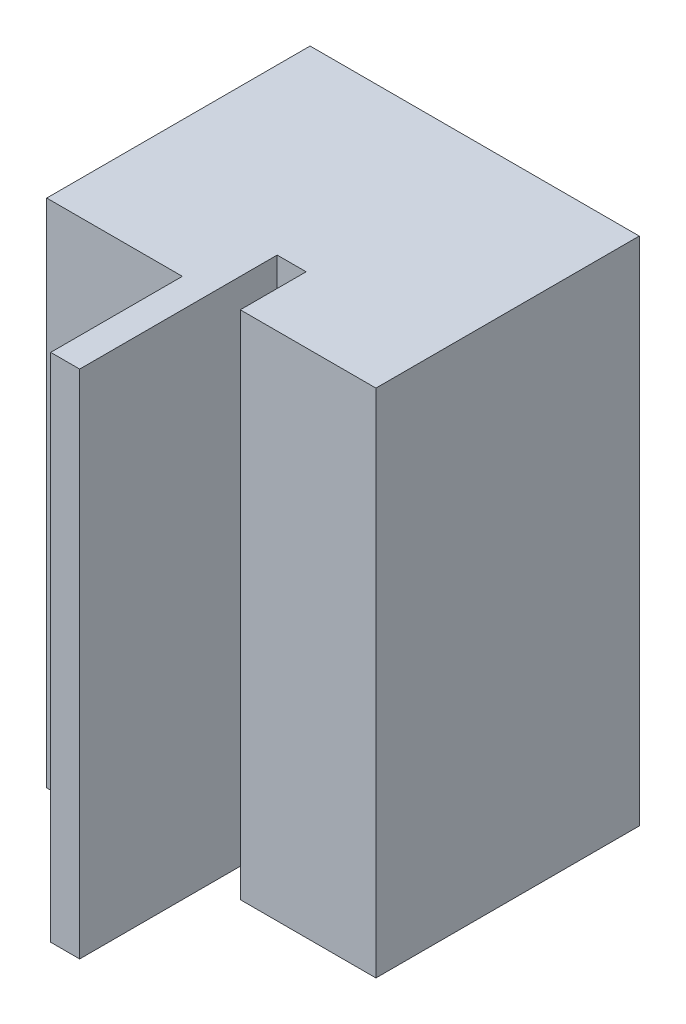
ISO-10303-21;
HEADER;
FILE_DESCRIPTION(('STEP AP214'),'2;1');
FILE_NAME('part.step','',(''),(''),'','','');
FILE_SCHEMA(('AUTOMOTIVE_DESIGN { 1 0 10303 214 1 1 1 1 }'));
ENDSEC;
DATA;
#1=APPLICATION_CONTEXT('core data for automotive mechanical design processes');
#2=APPLICATION_PROTOCOL_DEFINITION('international standard','automotive_design',2000,#1);
#3=PRODUCT_CONTEXT('',#1,'mechanical');
#4=PRODUCT('Part','Part','',(#3));
#5=PRODUCT_RELATED_PRODUCT_CATEGORY('part','',(#4));
#6=PRODUCT_DEFINITION_FORMATION('','',#4);
#7=PRODUCT_DEFINITION_CONTEXT('part definition',#1,'design');
#8=PRODUCT_DEFINITION('design','',#6,#7);
#9=PRODUCT_DEFINITION_SHAPE('','',#8);
#10=(LENGTH_UNIT() NAMED_UNIT(*) SI_UNIT(.MILLI.,.METRE.));
#11=(NAMED_UNIT(*) PLANE_ANGLE_UNIT() SI_UNIT($,.RADIAN.));
#12=(NAMED_UNIT(*) SI_UNIT($,.STERADIAN.) SOLID_ANGLE_UNIT());
#13=UNCERTAINTY_MEASURE_WITH_UNIT(LENGTH_MEASURE(1.E-05),#10,'distance_accuracy_value','');
#14=(GEOMETRIC_REPRESENTATION_CONTEXT(3) GLOBAL_UNCERTAINTY_ASSIGNED_CONTEXT((#13)) GLOBAL_UNIT_ASSIGNED_CONTEXT((#10,
#11,#12)) REPRESENTATION_CONTEXT('',''));
#15=CARTESIAN_POINT('',(0.,0.,0.));
#16=DIRECTION('',(0.,0.,1.));
#17=DIRECTION('',(1.,0.,0.));
#18=AXIS2_PLACEMENT_3D('',#15,#16,#17);
#19=CARTESIAN_POINT('',(0.,38.8,0.));
#20=DIRECTION('',(0.,-1.,0.));
#21=DIRECTION('',(0.,0.,-1.));
#22=AXIS2_PLACEMENT_3D('',#19,#20,#21);
#23=PLANE('',#22);
#24=DIRECTION('',(0.,0.,1.));
#25=VECTOR('',#24,1.);
#26=CARTESIAN_POINT('',(0.,38.8,20.));
#27=LINE('',#26,#25);
#28=CARTESIAN_POINT('',(0.,38.8,5.));
#29=VERTEX_POINT('',#28);
#30=CARTESIAN_POINT('',(0.,38.8,20.));
#31=VERTEX_POINT('',#30);
#32=EDGE_CURVE('E48',#29,#31,#27,.T.);
#33=ORIENTED_EDGE('',*,*,#32,.F.);
#34=DIRECTION('',(1.,0.,0.));
#35=VECTOR('',#34,1.);
#36=CARTESIAN_POINT('',(0.,38.8,5.));
#37=LINE('',#36,#35);
#38=CARTESIAN_POINT('',(2.2,38.8,5.));
#39=VERTEX_POINT('',#38);
#40=EDGE_CURVE('E142',#29,#39,#37,.T.);
#41=ORIENTED_EDGE('',*,*,#40,.T.);
#42=DIRECTION('',(0.,0.,1.));
#43=VECTOR('',#42,1.);
#44=CARTESIAN_POINT('',(2.2,38.8,20.));
#45=LINE('',#44,#43);
#46=CARTESIAN_POINT('',(2.2,38.8,10.));
#47=VERTEX_POINT('',#46);
#48=EDGE_CURVE('E118',#39,#47,#45,.T.);
#49=ORIENTED_EDGE('',*,*,#48,.T.);
#50=DIRECTION('',(1.,0.,0.));
#51=VECTOR('',#50,1.);
#52=CARTESIAN_POINT('',(-12.5,38.8,10.));
#53=LINE('',#52,#51);
#54=CARTESIAN_POINT('',(12.5,38.8,10.));
#55=VERTEX_POINT('',#54);
#56=EDGE_CURVE('E155',#47,#55,#53,.T.);
#57=ORIENTED_EDGE('',*,*,#56,.T.);
#58=DIRECTION('',(0.,0.,-1.));
#59=VECTOR('',#58,1.);
#60=CARTESIAN_POINT('',(12.5,38.8,10.));
#61=LINE('',#60,#59);
#62=CARTESIAN_POINT('',(12.5,38.8,-10.));
#63=VERTEX_POINT('',#62);
#64=EDGE_CURVE('E147',#55,#63,#61,.T.);
#65=ORIENTED_EDGE('',*,*,#64,.T.);
#66=DIRECTION('',(-1.,0.,0.));
#67=VECTOR('',#66,1.);
#68=CARTESIAN_POINT('',(-12.5,38.8,-10.));
#69=LINE('',#68,#67);
#70=CARTESIAN_POINT('',(-12.5,38.8,-10.));
#71=VERTEX_POINT('',#70);
#72=EDGE_CURVE('E150',#63,#71,#69,.T.);
#73=ORIENTED_EDGE('',*,*,#72,.T.);
#74=DIRECTION('',(0.,0.,1.));
#75=VECTOR('',#74,1.);
#76=CARTESIAN_POINT('',(-12.5,38.8,10.));
#77=LINE('',#76,#75);
#78=CARTESIAN_POINT('',(-12.5,38.8,10.));
#79=VERTEX_POINT('',#78);
#80=EDGE_CURVE('E153',#71,#79,#77,.T.);
#81=ORIENTED_EDGE('',*,*,#80,.T.);
#82=CARTESIAN_POINT('',(-2.2,38.8,10.));
#83=VERTEX_POINT('',#82);
#84=EDGE_CURVE('E156',#79,#83,#53,.T.);
#85=ORIENTED_EDGE('',*,*,#84,.T.);
#86=DIRECTION('',(0.,0.,1.));
#87=VECTOR('',#86,1.);
#88=CARTESIAN_POINT('',(-2.2,38.8,20.));
#89=LINE('',#88,#87);
#90=CARTESIAN_POINT('',(-2.2,38.8,20.));
#91=VERTEX_POINT('',#90);
#92=EDGE_CURVE('E56',#83,#91,#89,.T.);
#93=ORIENTED_EDGE('',*,*,#92,.T.);
#94=DIRECTION('',(1.,0.,0.));
#95=VECTOR('',#94,1.);
#96=CARTESIAN_POINT('',(-2.2,38.8,20.));
#97=LINE('',#96,#95);
#98=EDGE_CURVE('E137',#91,#31,#97,.T.);
#99=ORIENTED_EDGE('',*,*,#98,.T.);
#100=EDGE_LOOP('',(#33,#41,#49,#57,#65,#73,#81,#85,#93,#99));
#101=FACE_BOUND('',#100,.T.);
#102=ADVANCED_FACE('F33',(#101),#23,.F.);
#103=CARTESIAN_POINT('',(0.,0.,0.));
#104=DIRECTION('',(0.,-1.,0.));
#105=DIRECTION('',(0.,0.,-1.));
#106=AXIS2_PLACEMENT_3D('',#103,#104,#105);
#107=PLANE('',#106);
#108=DIRECTION('',(1.,0.,0.));
#109=VECTOR('',#108,1.);
#110=CARTESIAN_POINT('',(0.,0.,5.));
#111=LINE('',#110,#109);
#112=CARTESIAN_POINT('',(0.,0.,5.));
#113=VERTEX_POINT('',#112);
#114=CARTESIAN_POINT('',(2.2,0.,5.));
#115=VERTEX_POINT('',#114);
#116=EDGE_CURVE('E126',#113,#115,#111,.T.);
#117=ORIENTED_EDGE('',*,*,#116,.F.);
#118=DIRECTION('',(0.,0.,-1.));
#119=VECTOR('',#118,1.);
#120=CARTESIAN_POINT('',(0.,0.,20.));
#121=LINE('',#120,#119);
#122=CARTESIAN_POINT('',(0.,0.,20.));
#123=VERTEX_POINT('',#122);
#124=EDGE_CURVE('E112',#123,#113,#121,.T.);
#125=ORIENTED_EDGE('',*,*,#124,.F.);
#126=DIRECTION('',(1.,0.,0.));
#127=VECTOR('',#126,1.);
#128=CARTESIAN_POINT('',(-2.2,0.,20.));
#129=LINE('',#128,#127);
#130=CARTESIAN_POINT('',(-2.2,0.,20.));
#131=VERTEX_POINT('',#130);
#132=EDGE_CURVE('E124',#131,#123,#129,.T.);
#133=ORIENTED_EDGE('',*,*,#132,.F.);
#134=DIRECTION('',(0.,0.,1.));
#135=VECTOR('',#134,1.);
#136=CARTESIAN_POINT('',(-2.2,0.,20.));
#137=LINE('',#136,#135);
#138=CARTESIAN_POINT('',(-2.2,0.,10.));
#139=VERTEX_POINT('',#138);
#140=EDGE_CURVE('E133',#139,#131,#137,.T.);
#141=ORIENTED_EDGE('',*,*,#140,.F.);
#142=DIRECTION('',(1.,0.,0.));
#143=VECTOR('',#142,1.);
#144=CARTESIAN_POINT('',(-12.5,0.,10.));
#145=LINE('',#144,#143);
#146=CARTESIAN_POINT('',(-12.5,0.,10.));
#147=VERTEX_POINT('',#146);
#148=EDGE_CURVE('E151',#147,#139,#145,.T.);
#149=ORIENTED_EDGE('',*,*,#148,.F.);
#150=DIRECTION('',(0.,0.,1.));
#151=VECTOR('',#150,1.);
#152=CARTESIAN_POINT('',(-12.5,0.,10.));
#153=LINE('',#152,#151);
#154=CARTESIAN_POINT('',(-12.5,0.,-10.));
#155=VERTEX_POINT('',#154);
#156=EDGE_CURVE('E164',#155,#147,#153,.T.);
#157=ORIENTED_EDGE('',*,*,#156,.F.);
#158=DIRECTION('',(-1.,0.,0.));
#159=VECTOR('',#158,1.);
#160=CARTESIAN_POINT('',(-12.5,0.,-10.));
#161=LINE('',#160,#159);
#162=CARTESIAN_POINT('',(12.5,0.,-10.));
#163=VERTEX_POINT('',#162);
#164=EDGE_CURVE('E162',#163,#155,#161,.T.);
#165=ORIENTED_EDGE('',*,*,#164,.F.);
#166=DIRECTION('',(0.,0.,-1.));
#167=VECTOR('',#166,1.);
#168=CARTESIAN_POINT('',(12.5,0.,10.));
#169=LINE('',#168,#167);
#170=CARTESIAN_POINT('',(12.5,0.,10.));
#171=VERTEX_POINT('',#170);
#172=EDGE_CURVE('E145',#171,#163,#169,.T.);
#173=ORIENTED_EDGE('',*,*,#172,.F.);
#174=CARTESIAN_POINT('',(2.2,0.,10.));
#175=VERTEX_POINT('',#174);
#176=EDGE_CURVE('E166',#175,#171,#145,.T.);
#177=ORIENTED_EDGE('',*,*,#176,.F.);
#178=DIRECTION('',(0.,0.,-1.));
#179=VECTOR('',#178,1.);
#180=CARTESIAN_POINT('',(2.2,0.,20.));
#181=LINE('',#180,#179);
#182=EDGE_CURVE('E193',#175,#115,#181,.T.);
#183=ORIENTED_EDGE('',*,*,#182,.T.);
#184=EDGE_LOOP('',(#117,#125,#133,#141,#149,#157,#165,#173,#177,#183));
#185=FACE_BOUND('',#184,.T.);
#186=ADVANCED_FACE('F122',(#185),#107,.T.);
#187=CARTESIAN_POINT('',(-2.2,0.,20.));
#188=DIRECTION('',(0.,0.,1.));
#189=DIRECTION('',(1.,0.,0.));
#190=AXIS2_PLACEMENT_3D('',#187,#188,#189);
#191=PLANE('',#190);
#192=ORIENTED_EDGE('',*,*,#132,.T.);
#193=DIRECTION('',(0.,-1.,0.));
#194=VECTOR('',#193,1.);
#195=CARTESIAN_POINT('',(0.,38.8,20.));
#196=LINE('',#195,#194);
#197=EDGE_CURVE('E109',#31,#123,#196,.T.);
#198=ORIENTED_EDGE('',*,*,#197,.F.);
#199=ORIENTED_EDGE('',*,*,#98,.F.);
#200=DIRECTION('',(0.,1.,0.));
#201=VECTOR('',#200,1.);
#202=CARTESIAN_POINT('',(-2.2,0.,20.));
#203=LINE('',#202,#201);
#204=EDGE_CURVE('E130',#131,#91,#203,.T.);
#205=ORIENTED_EDGE('',*,*,#204,.F.);
#206=EDGE_LOOP('',(#192,#198,#199,#205));
#207=FACE_BOUND('',#206,.T.);
#208=ADVANCED_FACE('F129',(#207),#191,.T.);
#209=CARTESIAN_POINT('',(-12.5,38.8,10.));
#210=DIRECTION('',(0.,0.,-1.));
#211=DIRECTION('',(-1.,0.,0.));
#212=AXIS2_PLACEMENT_3D('',#209,#210,#211);
#213=PLANE('',#212);
#214=DIRECTION('',(0.,1.,0.));
#215=VECTOR('',#214,1.);
#216=CARTESIAN_POINT('',(2.2,0.,10.));
#217=LINE('',#216,#215);
#218=EDGE_CURVE('E132',#175,#47,#217,.T.);
#219=ORIENTED_EDGE('',*,*,#218,.F.);
#220=ORIENTED_EDGE('',*,*,#176,.T.);
#221=DIRECTION('',(0.,-1.,0.));
#222=VECTOR('',#221,1.);
#223=CARTESIAN_POINT('',(12.5,38.8,10.));
#224=LINE('',#223,#222);
#225=EDGE_CURVE('E159',#55,#171,#224,.T.);
#226=ORIENTED_EDGE('',*,*,#225,.F.);
#227=ORIENTED_EDGE('',*,*,#56,.F.);
#228=EDGE_LOOP('',(#219,#220,#226,#227));
#229=FACE_BOUND('',#228,.T.);
#230=ADVANCED_FACE('F196',(#229),#213,.F.);
#231=CARTESIAN_POINT('',(12.5,38.8,10.));
#232=DIRECTION('',(-1.,0.,0.));
#233=DIRECTION('',(0.,0.,1.));
#234=AXIS2_PLACEMENT_3D('',#231,#232,#233);
#235=PLANE('',#234);
#236=ORIENTED_EDGE('',*,*,#172,.T.);
#237=DIRECTION('',(0.,-1.,0.));
#238=VECTOR('',#237,1.);
#239=CARTESIAN_POINT('',(12.5,38.8,-10.));
#240=LINE('',#239,#238);
#241=EDGE_CURVE('E11',#63,#163,#240,.T.);
#242=ORIENTED_EDGE('',*,*,#241,.F.);
#243=ORIENTED_EDGE('',*,*,#64,.F.);
#244=ORIENTED_EDGE('',*,*,#225,.T.);
#245=EDGE_LOOP('',(#236,#242,#243,#244));
#246=FACE_BOUND('',#245,.T.);
#247=ADVANCED_FACE('F35',(#246),#235,.F.);
#248=CARTESIAN_POINT('',(-12.5,38.8,-10.));
#249=DIRECTION('',(0.,0.,1.));
#250=DIRECTION('',(1.,0.,0.));
#251=AXIS2_PLACEMENT_3D('',#248,#249,#250);
#252=PLANE('',#251);
#253=ORIENTED_EDGE('',*,*,#164,.T.);
#254=DIRECTION('',(0.,-1.,0.));
#255=VECTOR('',#254,1.);
#256=CARTESIAN_POINT('',(-12.5,38.8,-10.));
#257=LINE('',#256,#255);
#258=EDGE_CURVE('E41',#71,#155,#257,.T.);
#259=ORIENTED_EDGE('',*,*,#258,.F.);
#260=ORIENTED_EDGE('',*,*,#72,.F.);
#261=ORIENTED_EDGE('',*,*,#241,.T.);
#262=EDGE_LOOP('',(#253,#259,#260,#261));
#263=FACE_BOUND('',#262,.T.);
#264=ADVANCED_FACE('F189',(#263),#252,.F.);
#265=CARTESIAN_POINT('',(-12.5,38.8,10.));
#266=DIRECTION('',(1.,0.,0.));
#267=DIRECTION('',(0.,0.,-1.));
#268=AXIS2_PLACEMENT_3D('',#265,#266,#267);
#269=PLANE('',#268);
#270=ORIENTED_EDGE('',*,*,#156,.T.);
#271=DIRECTION('',(0.,-1.,0.));
#272=VECTOR('',#271,1.);
#273=CARTESIAN_POINT('',(-12.5,38.8,10.));
#274=LINE('',#273,#272);
#275=EDGE_CURVE('E171',#79,#147,#274,.T.);
#276=ORIENTED_EDGE('',*,*,#275,.F.);
#277=ORIENTED_EDGE('',*,*,#80,.F.);
#278=ORIENTED_EDGE('',*,*,#258,.T.);
#279=EDGE_LOOP('',(#270,#276,#277,#278));
#280=FACE_BOUND('',#279,.T.);
#281=ADVANCED_FACE('F178',(#280),#269,.F.);
#282=ORIENTED_EDGE('',*,*,#148,.T.);
#283=DIRECTION('',(0.,1.,0.));
#284=VECTOR('',#283,1.);
#285=CARTESIAN_POINT('',(-2.2,0.,10.));
#286=LINE('',#285,#284);
#287=EDGE_CURVE('E135',#139,#83,#286,.T.);
#288=ORIENTED_EDGE('',*,*,#287,.T.);
#289=ORIENTED_EDGE('',*,*,#84,.F.);
#290=ORIENTED_EDGE('',*,*,#275,.T.);
#291=EDGE_LOOP('',(#282,#288,#289,#290));
#292=FACE_BOUND('',#291,.T.);
#293=ADVANCED_FACE('F184',(#292),#213,.F.);
#294=CARTESIAN_POINT('',(-2.2,0.,20.));
#295=DIRECTION('',(-1.,0.,0.));
#296=DIRECTION('',(0.,0.,1.));
#297=AXIS2_PLACEMENT_3D('',#294,#295,#296);
#298=PLANE('',#297);
#299=ORIENTED_EDGE('',*,*,#92,.F.);
#300=ORIENTED_EDGE('',*,*,#287,.F.);
#301=ORIENTED_EDGE('',*,*,#140,.T.);
#302=ORIENTED_EDGE('',*,*,#204,.T.);
#303=EDGE_LOOP('',(#299,#300,#301,#302));
#304=FACE_BOUND('',#303,.T.);
#305=ADVANCED_FACE('F220',(#304),#298,.T.);
#306=CARTESIAN_POINT('',(2.2,0.,0.));
#307=DIRECTION('',(1.,0.,0.));
#308=DIRECTION('',(0.,0.,-1.));
#309=AXIS2_PLACEMENT_3D('',#306,#307,#308);
#310=PLANE('',#309);
#311=ORIENTED_EDGE('',*,*,#48,.F.);
#312=DIRECTION('',(0.,1.,0.));
#313=VECTOR('',#312,1.);
#314=CARTESIAN_POINT('',(2.2,38.8,5.));
#315=LINE('',#314,#313);
#316=EDGE_CURVE('E204',#115,#39,#315,.T.);
#317=ORIENTED_EDGE('',*,*,#316,.F.);
#318=ORIENTED_EDGE('',*,*,#182,.F.);
#319=ORIENTED_EDGE('',*,*,#218,.T.);
#320=EDGE_LOOP('',(#311,#317,#318,#319));
#321=FACE_BOUND('',#320,.T.);
#322=ADVANCED_FACE('F201',(#321),#310,.F.);
#323=CARTESIAN_POINT('',(0.,38.8,5.));
#324=DIRECTION('',(0.,0.,-1.));
#325=DIRECTION('',(0.,1.,0.));
#326=AXIS2_PLACEMENT_3D('',#323,#324,#325);
#327=PLANE('',#326);
#328=ORIENTED_EDGE('',*,*,#316,.T.);
#329=ORIENTED_EDGE('',*,*,#40,.F.);
#330=DIRECTION('',(0.,1.,0.));
#331=VECTOR('',#330,1.);
#332=CARTESIAN_POINT('',(0.,38.8,5.));
#333=LINE('',#332,#331);
#334=EDGE_CURVE('E127',#113,#29,#333,.T.);
#335=ORIENTED_EDGE('',*,*,#334,.F.);
#336=ORIENTED_EDGE('',*,*,#116,.T.);
#337=EDGE_LOOP('',(#328,#329,#335,#336));
#338=FACE_BOUND('',#337,.T.);
#339=ADVANCED_FACE('F212',(#338),#327,.F.);
#340=CARTESIAN_POINT('',(0.,0.,0.));
#341=DIRECTION('',(1.,0.,0.));
#342=DIRECTION('',(0.,0.,-1.));
#343=AXIS2_PLACEMENT_3D('',#340,#341,#342);
#344=PLANE('',#343);
#345=ORIENTED_EDGE('',*,*,#197,.T.);
#346=ORIENTED_EDGE('',*,*,#124,.T.);
#347=ORIENTED_EDGE('',*,*,#334,.T.);
#348=ORIENTED_EDGE('',*,*,#32,.T.);
#349=EDGE_LOOP('',(#345,#346,#347,#348));
#350=FACE_BOUND('',#349,.T.);
#351=ADVANCED_FACE('F111',(#350),#344,.T.);
#352=CLOSED_SHELL('',(#102,#186,#208,#230,#247,#264,#281,#293,#305,#322,#339,#351));
#353=MANIFOLD_SOLID_BREP('B2',#352);
#354=ADVANCED_BREP_SHAPE_REPRESENTATION('',(#18,#353),#14);
#355=SHAPE_DEFINITION_REPRESENTATION(#9,#354);
ENDSEC;
END-ISO-10303-21;
